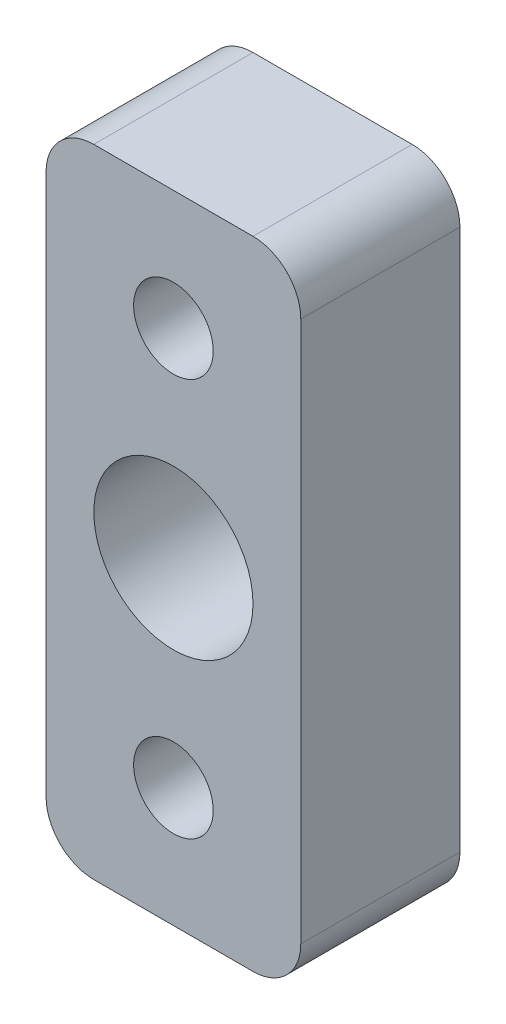
ISO-10303-21;
HEADER;
FILE_DESCRIPTION(('STEP AP214'),'2;1');
FILE_NAME('part.step','',(''),(''),'','','');
FILE_SCHEMA(('AUTOMOTIVE_DESIGN { 1 0 10303 214 1 1 1 1 }'));
ENDSEC;
DATA;
#1=APPLICATION_CONTEXT('core data for automotive mechanical design processes');
#2=APPLICATION_PROTOCOL_DEFINITION('international standard','automotive_design',2000,#1);
#3=PRODUCT_CONTEXT('',#1,'mechanical');
#4=PRODUCT('Part','Part','',(#3));
#5=PRODUCT_RELATED_PRODUCT_CATEGORY('part','',(#4));
#6=PRODUCT_DEFINITION_FORMATION('','',#4);
#7=PRODUCT_DEFINITION_CONTEXT('part definition',#1,'design');
#8=PRODUCT_DEFINITION('design','',#6,#7);
#9=PRODUCT_DEFINITION_SHAPE('','',#8);
#10=(LENGTH_UNIT() NAMED_UNIT(*) SI_UNIT(.MILLI.,.METRE.));
#11=(NAMED_UNIT(*) PLANE_ANGLE_UNIT() SI_UNIT($,.RADIAN.));
#12=(NAMED_UNIT(*) SI_UNIT($,.STERADIAN.) SOLID_ANGLE_UNIT());
#13=UNCERTAINTY_MEASURE_WITH_UNIT(LENGTH_MEASURE(1.E-05),#10,'distance_accuracy_value','');
#14=(GEOMETRIC_REPRESENTATION_CONTEXT(3) GLOBAL_UNCERTAINTY_ASSIGNED_CONTEXT((#13)) GLOBAL_UNIT_ASSIGNED_CONTEXT((#10,
#11,#12)) REPRESENTATION_CONTEXT('',''));
#15=CARTESIAN_POINT('',(0.,0.,0.));
#16=DIRECTION('',(0.,0.,1.));
#17=DIRECTION('',(1.,0.,0.));
#18=AXIS2_PLACEMENT_3D('',#15,#16,#17);
#19=CARTESIAN_POINT('',(0.,0.,10.));
#20=DIRECTION('',(0.,0.,1.));
#21=DIRECTION('',(1.,0.,0.));
#22=AXIS2_PLACEMENT_3D('',#19,#20,#21);
#23=PLANE('',#22);
#24=CARTESIAN_POINT('',(0.,0.,10.));
#25=DIRECTION('',(0.,0.,1.));
#26=DIRECTION('',(1.,0.,0.));
#27=AXIS2_PLACEMENT_3D('',#24,#25,#26);
#28=CIRCLE('',#27,2.5);
#29=CARTESIAN_POINT('',(2.5,0.,10.));
#30=VERTEX_POINT('',#29);
#31=EDGE_CURVE('E184',#30,#30,#28,.T.);
#32=ORIENTED_EDGE('',*,*,#31,.F.);
#33=EDGE_LOOP('',(#32));
#34=FACE_BOUND('',#33,.T.);
#35=DIRECTION('',(0.,1.,0.));
#36=VECTOR('',#35,1.);
#37=CARTESIAN_POINT('',(8.,32.5,10.));
#38=LINE('',#37,#36);
#39=CARTESIAN_POINT('',(8.,-4.49999999999999,10.));
#40=VERTEX_POINT('',#39);
#41=CARTESIAN_POINT('',(8.,29.5,10.));
#42=VERTEX_POINT('',#41);
#43=EDGE_CURVE('E141',#40,#42,#38,.T.);
#44=ORIENTED_EDGE('',*,*,#43,.T.);
#45=CARTESIAN_POINT('',(5.,29.5,10.));
#46=DIRECTION('',(0.,0.,1.));
#47=DIRECTION('',(1.,0.,0.));
#48=AXIS2_PLACEMENT_3D('',#45,#46,#47);
#49=CIRCLE('',#48,3.);
#50=CARTESIAN_POINT('',(5.,32.5,10.));
#51=VERTEX_POINT('',#50);
#52=EDGE_CURVE('E156',#42,#51,#49,.T.);
#53=ORIENTED_EDGE('',*,*,#52,.T.);
#54=DIRECTION('',(-1.,0.,0.));
#55=VECTOR('',#54,1.);
#56=CARTESIAN_POINT('',(-8.,32.5,10.));
#57=LINE('',#56,#55);
#58=CARTESIAN_POINT('',(-5.,32.5,10.));
#59=VERTEX_POINT('',#58);
#60=EDGE_CURVE('E123',#51,#59,#57,.T.);
#61=ORIENTED_EDGE('',*,*,#60,.T.);
#62=CARTESIAN_POINT('',(-5.,29.5,10.));
#63=DIRECTION('',(0.,0.,1.));
#64=DIRECTION('',(1.,0.,0.));
#65=AXIS2_PLACEMENT_3D('',#62,#63,#64);
#66=CIRCLE('',#65,3.);
#67=CARTESIAN_POINT('',(-8.,29.5,10.));
#68=VERTEX_POINT('',#67);
#69=EDGE_CURVE('E154',#59,#68,#66,.T.);
#70=ORIENTED_EDGE('',*,*,#69,.T.);
#71=DIRECTION('',(0.,-1.,0.));
#72=VECTOR('',#71,1.);
#73=CARTESIAN_POINT('',(-8.,32.5,10.));
#74=LINE('',#73,#72);
#75=CARTESIAN_POINT('',(-8.,-4.49999999999999,10.));
#76=VERTEX_POINT('',#75);
#77=EDGE_CURVE('E167',#68,#76,#74,.T.);
#78=ORIENTED_EDGE('',*,*,#77,.T.);
#79=CARTESIAN_POINT('',(-5.,-4.49999999999999,10.));
#80=DIRECTION('',(0.,0.,1.));
#81=DIRECTION('',(1.,0.,0.));
#82=AXIS2_PLACEMENT_3D('',#79,#80,#81);
#83=CIRCLE('',#82,3.);
#84=CARTESIAN_POINT('',(-5.,-7.49999999999999,10.));
#85=VERTEX_POINT('',#84);
#86=EDGE_CURVE('E58',#76,#85,#83,.T.);
#87=ORIENTED_EDGE('',*,*,#86,.T.);
#88=DIRECTION('',(1.,0.,0.));
#89=VECTOR('',#88,1.);
#90=CARTESIAN_POINT('',(-8.,-7.49999999999999,10.));
#91=LINE('',#90,#89);
#92=CARTESIAN_POINT('',(5.,-7.49999999999999,10.));
#93=VERTEX_POINT('',#92);
#94=EDGE_CURVE('E142',#85,#93,#91,.T.);
#95=ORIENTED_EDGE('',*,*,#94,.T.);
#96=CARTESIAN_POINT('',(5.,-4.49999999999999,10.));
#97=DIRECTION('',(0.,0.,1.));
#98=DIRECTION('',(1.,0.,0.));
#99=AXIS2_PLACEMENT_3D('',#96,#97,#98);
#100=CIRCLE('',#99,3.);
#101=EDGE_CURVE('E151',#93,#40,#100,.T.);
#102=ORIENTED_EDGE('',*,*,#101,.T.);
#103=EDGE_LOOP('',(#44,#53,#61,#70,#78,#87,#95,#102));
#104=FACE_BOUND('',#103,.T.);
#105=CARTESIAN_POINT('',(0.,25.,10.));
#106=DIRECTION('',(0.,0.,1.));
#107=DIRECTION('',(1.,0.,0.));
#108=AXIS2_PLACEMENT_3D('',#105,#106,#107);
#109=CIRCLE('',#108,2.5);
#110=CARTESIAN_POINT('',(2.5,25.,10.));
#111=VERTEX_POINT('',#110);
#112=EDGE_CURVE('E136',#111,#111,#109,.T.);
#113=ORIENTED_EDGE('',*,*,#112,.F.);
#114=EDGE_LOOP('',(#113));
#115=FACE_BOUND('',#114,.T.);
#116=CARTESIAN_POINT('',(0.,12.5,10.));
#117=DIRECTION('',(0.,0.,1.));
#118=DIRECTION('',(1.,0.,0.));
#119=AXIS2_PLACEMENT_3D('',#116,#117,#118);
#120=CIRCLE('',#119,5.);
#121=CARTESIAN_POINT('',(5.,12.5,10.));
#122=VERTEX_POINT('',#121);
#123=EDGE_CURVE('E190',#122,#122,#120,.T.);
#124=ORIENTED_EDGE('',*,*,#123,.F.);
#125=EDGE_LOOP('',(#124));
#126=FACE_BOUND('',#125,.T.);
#127=ADVANCED_FACE('F37',(#34,#104,#115,#126),#23,.T.);
#128=CARTESIAN_POINT('',(0.,0.,0.));
#129=DIRECTION('',(0.,0.,1.));
#130=DIRECTION('',(1.,0.,0.));
#131=AXIS2_PLACEMENT_3D('',#128,#129,#130);
#132=PLANE('',#131);
#133=DIRECTION('',(-1.,0.,0.));
#134=VECTOR('',#133,1.);
#135=CARTESIAN_POINT('',(-8.,32.5,0.));
#136=LINE('',#135,#134);
#137=CARTESIAN_POINT('',(5.,32.5,0.));
#138=VERTEX_POINT('',#137);
#139=CARTESIAN_POINT('',(-5.,32.5,0.));
#140=VERTEX_POINT('',#139);
#141=EDGE_CURVE('E120',#138,#140,#136,.T.);
#142=ORIENTED_EDGE('',*,*,#141,.F.);
#143=CARTESIAN_POINT('',(5.,29.5,0.));
#144=DIRECTION('',(0.,0.,1.));
#145=DIRECTION('',(1.,0.,0.));
#146=AXIS2_PLACEMENT_3D('',#143,#144,#145);
#147=CIRCLE('',#146,3.);
#148=CARTESIAN_POINT('',(8.,29.5,0.));
#149=VERTEX_POINT('',#148);
#150=EDGE_CURVE('E103',#138,#149,#147,.F.);
#151=ORIENTED_EDGE('',*,*,#150,.T.);
#152=DIRECTION('',(0.,1.,0.));
#153=VECTOR('',#152,1.);
#154=CARTESIAN_POINT('',(8.,32.5,0.));
#155=LINE('',#154,#153);
#156=CARTESIAN_POINT('',(8.,-4.49999999999999,0.));
#157=VERTEX_POINT('',#156);
#158=EDGE_CURVE('E131',#157,#149,#155,.T.);
#159=ORIENTED_EDGE('',*,*,#158,.F.);
#160=CARTESIAN_POINT('',(5.,-4.49999999999999,0.));
#161=DIRECTION('',(0.,0.,1.));
#162=DIRECTION('',(1.,0.,0.));
#163=AXIS2_PLACEMENT_3D('',#160,#161,#162);
#164=CIRCLE('',#163,3.);
#165=CARTESIAN_POINT('',(5.,-7.49999999999999,0.));
#166=VERTEX_POINT('',#165);
#167=EDGE_CURVE('E124',#157,#166,#164,.F.);
#168=ORIENTED_EDGE('',*,*,#167,.T.);
#169=DIRECTION('',(1.,0.,0.));
#170=VECTOR('',#169,1.);
#171=CARTESIAN_POINT('',(-8.,-7.49999999999999,0.));
#172=LINE('',#171,#170);
#173=CARTESIAN_POINT('',(-5.,-7.49999999999999,0.));
#174=VERTEX_POINT('',#173);
#175=EDGE_CURVE('E134',#174,#166,#172,.T.);
#176=ORIENTED_EDGE('',*,*,#175,.F.);
#177=CARTESIAN_POINT('',(-5.,-4.49999999999999,0.));
#178=DIRECTION('',(0.,0.,1.));
#179=DIRECTION('',(1.,0.,0.));
#180=AXIS2_PLACEMENT_3D('',#177,#178,#179);
#181=CIRCLE('',#180,3.);
#182=CARTESIAN_POINT('',(-8.,-4.49999999999999,0.));
#183=VERTEX_POINT('',#182);
#184=EDGE_CURVE('E145',#174,#183,#181,.F.);
#185=ORIENTED_EDGE('',*,*,#184,.T.);
#186=DIRECTION('',(0.,-1.,0.));
#187=VECTOR('',#186,1.);
#188=CARTESIAN_POINT('',(-8.,32.5,0.));
#189=LINE('',#188,#187);
#190=CARTESIAN_POINT('',(-8.,29.5,0.));
#191=VERTEX_POINT('',#190);
#192=EDGE_CURVE('E130',#191,#183,#189,.T.);
#193=ORIENTED_EDGE('',*,*,#192,.F.);
#194=CARTESIAN_POINT('',(-5.,29.5,0.));
#195=DIRECTION('',(0.,0.,1.));
#196=DIRECTION('',(1.,0.,0.));
#197=AXIS2_PLACEMENT_3D('',#194,#195,#196);
#198=CIRCLE('',#197,3.);
#199=EDGE_CURVE('E114',#191,#140,#198,.F.);
#200=ORIENTED_EDGE('',*,*,#199,.T.);
#201=EDGE_LOOP('',(#142,#151,#159,#168,#176,#185,#193,#200));
#202=FACE_BOUND('',#201,.T.);
#203=CARTESIAN_POINT('',(0.,25.,0.));
#204=DIRECTION('',(0.,0.,1.));
#205=DIRECTION('',(1.,0.,0.));
#206=AXIS2_PLACEMENT_3D('',#203,#204,#205);
#207=CIRCLE('',#206,2.5);
#208=CARTESIAN_POINT('',(2.5,25.,0.));
#209=VERTEX_POINT('',#208);
#210=EDGE_CURVE('E181',#209,#209,#207,.T.);
#211=ORIENTED_EDGE('',*,*,#210,.T.);
#212=EDGE_LOOP('',(#211));
#213=FACE_BOUND('',#212,.T.);
#214=CARTESIAN_POINT('',(0.,0.,0.));
#215=DIRECTION('',(0.,0.,1.));
#216=DIRECTION('',(1.,0.,0.));
#217=AXIS2_PLACEMENT_3D('',#214,#215,#216);
#218=CIRCLE('',#217,2.5);
#219=CARTESIAN_POINT('',(2.5,0.,0.));
#220=VERTEX_POINT('',#219);
#221=EDGE_CURVE('E187',#220,#220,#218,.T.);
#222=ORIENTED_EDGE('',*,*,#221,.T.);
#223=EDGE_LOOP('',(#222));
#224=FACE_BOUND('',#223,.T.);
#225=CARTESIAN_POINT('',(0.,12.5,0.));
#226=DIRECTION('',(0.,0.,1.));
#227=DIRECTION('',(1.,0.,0.));
#228=AXIS2_PLACEMENT_3D('',#225,#226,#227);
#229=CIRCLE('',#228,5.);
#230=CARTESIAN_POINT('',(5.,12.5,0.));
#231=VERTEX_POINT('',#230);
#232=EDGE_CURVE('E193',#231,#231,#229,.T.);
#233=ORIENTED_EDGE('',*,*,#232,.T.);
#234=EDGE_LOOP('',(#233));
#235=FACE_BOUND('',#234,.T.);
#236=ADVANCED_FACE('F127',(#202,#213,#224,#235),#132,.F.);
#237=CARTESIAN_POINT('',(8.,32.5,10.));
#238=DIRECTION('',(-1.,0.,0.));
#239=DIRECTION('',(0.,-1.,0.));
#240=AXIS2_PLACEMENT_3D('',#237,#238,#239);
#241=PLANE('',#240);
#242=ORIENTED_EDGE('',*,*,#158,.T.);
#243=DIRECTION('',(0.,0.,-1.));
#244=VECTOR('',#243,1.);
#245=CARTESIAN_POINT('',(8.,29.5,10.));
#246=LINE('',#245,#244);
#247=EDGE_CURVE('E108',#149,#42,#246,.F.);
#248=ORIENTED_EDGE('',*,*,#247,.T.);
#249=ORIENTED_EDGE('',*,*,#43,.F.);
#250=DIRECTION('',(0.,0.,-1.));
#251=VECTOR('',#250,1.);
#252=CARTESIAN_POINT('',(8.,-4.49999999999999,10.));
#253=LINE('',#252,#251);
#254=EDGE_CURVE('E113',#40,#157,#253,.T.);
#255=ORIENTED_EDGE('',*,*,#254,.T.);
#256=EDGE_LOOP('',(#242,#248,#249,#255));
#257=FACE_BOUND('',#256,.T.);
#258=ADVANCED_FACE('F208',(#257),#241,.F.);
#259=CARTESIAN_POINT('',(-8.,32.5,10.));
#260=DIRECTION('',(0.,-1.,0.));
#261=DIRECTION('',(0.,0.,-1.));
#262=AXIS2_PLACEMENT_3D('',#259,#260,#261);
#263=PLANE('',#262);
#264=ORIENTED_EDGE('',*,*,#60,.F.);
#265=DIRECTION('',(0.,0.,-1.));
#266=VECTOR('',#265,1.);
#267=CARTESIAN_POINT('',(5.,32.5,10.));
#268=LINE('',#267,#266);
#269=EDGE_CURVE('E107',#51,#138,#268,.T.);
#270=ORIENTED_EDGE('',*,*,#269,.T.);
#271=ORIENTED_EDGE('',*,*,#141,.T.);
#272=DIRECTION('',(0.,0.,-1.));
#273=VECTOR('',#272,1.);
#274=CARTESIAN_POINT('',(-5.,32.5,10.));
#275=LINE('',#274,#273);
#276=EDGE_CURVE('E125',#140,#59,#275,.F.);
#277=ORIENTED_EDGE('',*,*,#276,.T.);
#278=EDGE_LOOP('',(#264,#270,#271,#277));
#279=FACE_BOUND('',#278,.T.);
#280=ADVANCED_FACE('F119',(#279),#263,.F.);
#281=CARTESIAN_POINT('',(-8.,32.5,10.));
#282=DIRECTION('',(1.,0.,0.));
#283=DIRECTION('',(0.,1.,0.));
#284=AXIS2_PLACEMENT_3D('',#281,#282,#283);
#285=PLANE('',#284);
#286=ORIENTED_EDGE('',*,*,#77,.F.);
#287=DIRECTION('',(0.,0.,-1.));
#288=VECTOR('',#287,1.);
#289=CARTESIAN_POINT('',(-8.,29.5,10.));
#290=LINE('',#289,#288);
#291=EDGE_CURVE('E160',#68,#191,#290,.T.);
#292=ORIENTED_EDGE('',*,*,#291,.T.);
#293=ORIENTED_EDGE('',*,*,#192,.T.);
#294=DIRECTION('',(0.,0.,-1.));
#295=VECTOR('',#294,1.);
#296=CARTESIAN_POINT('',(-8.,-4.49999999999999,10.));
#297=LINE('',#296,#295);
#298=EDGE_CURVE('E158',#183,#76,#297,.F.);
#299=ORIENTED_EDGE('',*,*,#298,.T.);
#300=EDGE_LOOP('',(#286,#292,#293,#299));
#301=FACE_BOUND('',#300,.T.);
#302=ADVANCED_FACE('F165',(#301),#285,.F.);
#303=CARTESIAN_POINT('',(-8.,-7.49999999999999,10.));
#304=DIRECTION('',(0.,1.,0.));
#305=DIRECTION('',(0.,0.,1.));
#306=AXIS2_PLACEMENT_3D('',#303,#304,#305);
#307=PLANE('',#306);
#308=ORIENTED_EDGE('',*,*,#94,.F.);
#309=DIRECTION('',(0.,0.,-1.));
#310=VECTOR('',#309,1.);
#311=CARTESIAN_POINT('',(-5.,-7.49999999999999,10.));
#312=LINE('',#311,#310);
#313=EDGE_CURVE('E11',#85,#174,#312,.T.);
#314=ORIENTED_EDGE('',*,*,#313,.T.);
#315=ORIENTED_EDGE('',*,*,#175,.T.);
#316=DIRECTION('',(0.,0.,-1.));
#317=VECTOR('',#316,1.);
#318=CARTESIAN_POINT('',(5.,-7.49999999999999,10.));
#319=LINE('',#318,#317);
#320=EDGE_CURVE('E45',#166,#93,#319,.F.);
#321=ORIENTED_EDGE('',*,*,#320,.T.);
#322=EDGE_LOOP('',(#308,#314,#315,#321));
#323=FACE_BOUND('',#322,.T.);
#324=ADVANCED_FACE('F174',(#323),#307,.F.);
#325=CARTESIAN_POINT('',(0.,25.,10.));
#326=DIRECTION('',(0.,0.,-1.));
#327=DIRECTION('',(-1.,0.,0.));
#328=AXIS2_PLACEMENT_3D('',#325,#326,#327);
#329=CYLINDRICAL_SURFACE('',#328,2.5);
#330=ORIENTED_EDGE('',*,*,#112,.T.);
#331=EDGE_LOOP('',(#330));
#332=FACE_BOUND('',#331,.T.);
#333=ORIENTED_EDGE('',*,*,#210,.F.);
#334=EDGE_LOOP('',(#333));
#335=FACE_BOUND('',#334,.T.);
#336=ADVANCED_FACE('F212',(#332,#335),#329,.F.);
#337=CARTESIAN_POINT('',(0.,0.,10.));
#338=DIRECTION('',(0.,0.,-1.));
#339=DIRECTION('',(-1.,0.,0.));
#340=AXIS2_PLACEMENT_3D('',#337,#338,#339);
#341=CYLINDRICAL_SURFACE('',#340,2.5);
#342=ORIENTED_EDGE('',*,*,#31,.T.);
#343=EDGE_LOOP('',(#342));
#344=FACE_BOUND('',#343,.T.);
#345=ORIENTED_EDGE('',*,*,#221,.F.);
#346=EDGE_LOOP('',(#345));
#347=FACE_BOUND('',#346,.T.);
#348=ADVANCED_FACE('F242',(#344,#347),#341,.F.);
#349=CARTESIAN_POINT('',(0.,12.5,10.));
#350=DIRECTION('',(0.,0.,-1.));
#351=DIRECTION('',(-1.,0.,0.));
#352=AXIS2_PLACEMENT_3D('',#349,#350,#351);
#353=CYLINDRICAL_SURFACE('',#352,5.);
#354=ORIENTED_EDGE('',*,*,#123,.T.);
#355=EDGE_LOOP('',(#354));
#356=FACE_BOUND('',#355,.T.);
#357=ORIENTED_EDGE('',*,*,#232,.F.);
#358=EDGE_LOOP('',(#357));
#359=FACE_BOUND('',#358,.T.);
#360=ADVANCED_FACE('F199',(#356,#359),#353,.F.);
#361=CARTESIAN_POINT('',(5.,29.5,10.));
#362=DIRECTION('',(0.,0.,-1.));
#363=DIRECTION('',(-1.,0.,0.));
#364=AXIS2_PLACEMENT_3D('',#361,#362,#363);
#365=CYLINDRICAL_SURFACE('',#364,3.);
#366=ORIENTED_EDGE('',*,*,#52,.F.);
#367=ORIENTED_EDGE('',*,*,#247,.F.);
#368=ORIENTED_EDGE('',*,*,#150,.F.);
#369=ORIENTED_EDGE('',*,*,#269,.F.);
#370=EDGE_LOOP('',(#366,#367,#368,#369));
#371=FACE_BOUND('',#370,.T.);
#372=ADVANCED_FACE('F106',(#371),#365,.T.);
#373=CARTESIAN_POINT('',(-5.,29.5,10.));
#374=DIRECTION('',(0.,0.,-1.));
#375=DIRECTION('',(-1.,0.,0.));
#376=AXIS2_PLACEMENT_3D('',#373,#374,#375);
#377=CYLINDRICAL_SURFACE('',#376,3.);
#378=ORIENTED_EDGE('',*,*,#69,.F.);
#379=ORIENTED_EDGE('',*,*,#276,.F.);
#380=ORIENTED_EDGE('',*,*,#199,.F.);
#381=ORIENTED_EDGE('',*,*,#291,.F.);
#382=EDGE_LOOP('',(#378,#379,#380,#381));
#383=FACE_BOUND('',#382,.T.);
#384=ADVANCED_FACE('F226',(#383),#377,.T.);
#385=CARTESIAN_POINT('',(-5.,-4.49999999999999,10.));
#386=DIRECTION('',(0.,0.,-1.));
#387=DIRECTION('',(-1.,0.,0.));
#388=AXIS2_PLACEMENT_3D('',#385,#386,#387);
#389=CYLINDRICAL_SURFACE('',#388,3.);
#390=ORIENTED_EDGE('',*,*,#86,.F.);
#391=ORIENTED_EDGE('',*,*,#298,.F.);
#392=ORIENTED_EDGE('',*,*,#184,.F.);
#393=ORIENTED_EDGE('',*,*,#313,.F.);
#394=EDGE_LOOP('',(#390,#391,#392,#393));
#395=FACE_BOUND('',#394,.T.);
#396=ADVANCED_FACE('F173',(#395),#389,.T.);
#397=CARTESIAN_POINT('',(5.,-4.49999999999999,10.));
#398=DIRECTION('',(0.,0.,-1.));
#399=DIRECTION('',(-1.,0.,0.));
#400=AXIS2_PLACEMENT_3D('',#397,#398,#399);
#401=CYLINDRICAL_SURFACE('',#400,3.);
#402=ORIENTED_EDGE('',*,*,#101,.F.);
#403=ORIENTED_EDGE('',*,*,#320,.F.);
#404=ORIENTED_EDGE('',*,*,#167,.F.);
#405=ORIENTED_EDGE('',*,*,#254,.F.);
#406=EDGE_LOOP('',(#402,#403,#404,#405));
#407=FACE_BOUND('',#406,.T.);
#408=ADVANCED_FACE('F39',(#407),#401,.T.);
#409=CLOSED_SHELL('',(#127,#236,#258,#280,#302,#324,#336,#348,#360,#372,#384,#396,#408));
#410=MANIFOLD_SOLID_BREP('B2',#409);
#411=ADVANCED_BREP_SHAPE_REPRESENTATION('',(#18,#410),#14);
#412=SHAPE_DEFINITION_REPRESENTATION(#9,#411);
ENDSEC;
END-ISO-10303-21;
